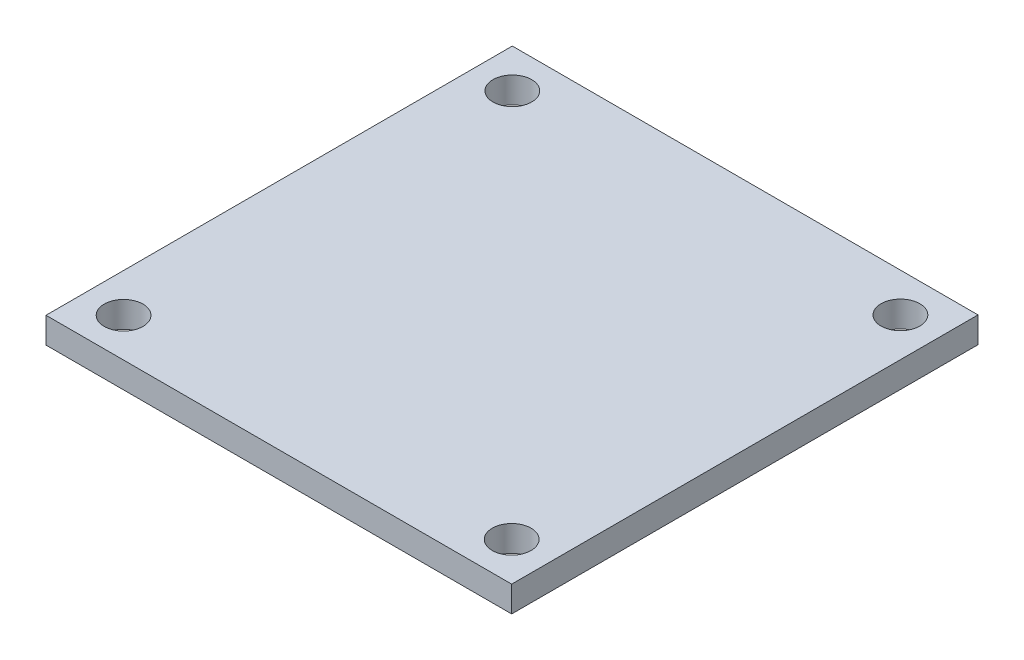
ISO-10303-21;
HEADER;
FILE_DESCRIPTION(('STEP AP214'),'2;1');
FILE_NAME('part.step','',(''),(''),'','','');
FILE_SCHEMA(('AUTOMOTIVE_DESIGN { 1 0 10303 214 1 1 1 1 }'));
ENDSEC;
DATA;
#1=APPLICATION_CONTEXT('core data for automotive mechanical design processes');
#2=APPLICATION_PROTOCOL_DEFINITION('international standard','automotive_design',2000,#1);
#3=PRODUCT_CONTEXT('',#1,'mechanical');
#4=PRODUCT('Part','Part','',(#3));
#5=PRODUCT_RELATED_PRODUCT_CATEGORY('part','',(#4));
#6=PRODUCT_DEFINITION_FORMATION('','',#4);
#7=PRODUCT_DEFINITION_CONTEXT('part definition',#1,'design');
#8=PRODUCT_DEFINITION('design','',#6,#7);
#9=PRODUCT_DEFINITION_SHAPE('','',#8);
#10=(LENGTH_UNIT() NAMED_UNIT(*) SI_UNIT(.MILLI.,.METRE.));
#11=(NAMED_UNIT(*) PLANE_ANGLE_UNIT() SI_UNIT($,.RADIAN.));
#12=(NAMED_UNIT(*) SI_UNIT($,.STERADIAN.) SOLID_ANGLE_UNIT());
#13=UNCERTAINTY_MEASURE_WITH_UNIT(LENGTH_MEASURE(1.E-05),#10,'distance_accuracy_value','');
#14=(GEOMETRIC_REPRESENTATION_CONTEXT(3) GLOBAL_UNCERTAINTY_ASSIGNED_CONTEXT((#13)) GLOBAL_UNIT_ASSIGNED_CONTEXT((#10,
#11,#12)) REPRESENTATION_CONTEXT('',''));
#15=CARTESIAN_POINT('',(0.,0.,0.));
#16=DIRECTION('',(0.,0.,1.));
#17=DIRECTION('',(1.,0.,0.));
#18=AXIS2_PLACEMENT_3D('',#15,#16,#17);
#19=CARTESIAN_POINT('',(0.,2.,0.));
#20=DIRECTION('',(0.,-1.,0.));
#21=DIRECTION('',(0.,0.,-1.));
#22=AXIS2_PLACEMENT_3D('',#19,#20,#21);
#23=PLANE('',#22);
#24=DIRECTION('',(0.,0.,-1.));
#25=VECTOR('',#24,1.);
#26=CARTESIAN_POINT('',(18.0086,2.,18.034));
#27=LINE('',#26,#25);
#28=CARTESIAN_POINT('',(18.0086,2.,18.034));
#29=VERTEX_POINT('',#28);
#30=CARTESIAN_POINT('',(18.0086,2.,-18.034));
#31=VERTEX_POINT('',#30);
#32=EDGE_CURVE('E84',#29,#31,#27,.T.);
#33=ORIENTED_EDGE('',*,*,#32,.T.);
#34=DIRECTION('',(-1.,0.,0.));
#35=VECTOR('',#34,1.);
#36=CARTESIAN_POINT('',(-18.0086,2.,-18.034));
#37=LINE('',#36,#35);
#38=CARTESIAN_POINT('',(-18.0086,2.,-18.034));
#39=VERTEX_POINT('',#38);
#40=EDGE_CURVE('E79',#31,#39,#37,.T.);
#41=ORIENTED_EDGE('',*,*,#40,.T.);
#42=DIRECTION('',(0.,0.,1.));
#43=VECTOR('',#42,1.);
#44=CARTESIAN_POINT('',(-18.0086,2.,18.034));
#45=LINE('',#44,#43);
#46=CARTESIAN_POINT('',(-18.0086,2.,18.034));
#47=VERTEX_POINT('',#46);
#48=EDGE_CURVE('E82',#39,#47,#45,.T.);
#49=ORIENTED_EDGE('',*,*,#48,.T.);
#50=DIRECTION('',(1.,0.,0.));
#51=VECTOR('',#50,1.);
#52=CARTESIAN_POINT('',(-18.0086,2.,18.034));
#53=LINE('',#52,#51);
#54=EDGE_CURVE('E49',#47,#29,#53,.T.);
#55=ORIENTED_EDGE('',*,*,#54,.T.);
#56=EDGE_LOOP('',(#33,#41,#49,#55));
#57=FACE_BOUND('',#56,.T.);
#58=CARTESIAN_POINT('',(-15.0086,2.,-15.034));
#59=DIRECTION('',(0.,1.,0.));
#60=DIRECTION('',(0.,0.,1.));
#61=AXIS2_PLACEMENT_3D('',#58,#59,#60);
#62=CIRCLE('',#61,1.5);
#63=CARTESIAN_POINT('',(-15.0086,2.,-13.534));
#64=VERTEX_POINT('',#63);
#65=EDGE_CURVE('E99',#64,#64,#62,.T.);
#66=ORIENTED_EDGE('',*,*,#65,.F.);
#67=EDGE_LOOP('',(#66));
#68=FACE_BOUND('',#67,.T.);
#69=CARTESIAN_POINT('',(15.0086,2.,-15.034));
#70=DIRECTION('',(0.,1.,0.));
#71=DIRECTION('',(0.,0.,-1.));
#72=AXIS2_PLACEMENT_3D('',#69,#70,#71);
#73=CIRCLE('',#72,1.5);
#74=CARTESIAN_POINT('',(15.0086,2.,-16.534));
#75=VERTEX_POINT('',#74);
#76=EDGE_CURVE('E114',#75,#75,#73,.T.);
#77=ORIENTED_EDGE('',*,*,#76,.F.);
#78=EDGE_LOOP('',(#77));
#79=FACE_BOUND('',#78,.T.);
#80=CARTESIAN_POINT('',(-15.0086,2.,15.034));
#81=DIRECTION('',(0.,1.,0.));
#82=DIRECTION('',(0.,0.,-1.));
#83=AXIS2_PLACEMENT_3D('',#80,#81,#82);
#84=CIRCLE('',#83,1.5);
#85=CARTESIAN_POINT('',(-15.0086,2.,13.534));
#86=VERTEX_POINT('',#85);
#87=EDGE_CURVE('E120',#86,#86,#84,.T.);
#88=ORIENTED_EDGE('',*,*,#87,.F.);
#89=EDGE_LOOP('',(#88));
#90=FACE_BOUND('',#89,.T.);
#91=CARTESIAN_POINT('',(15.0086,2.,15.034));
#92=DIRECTION('',(0.,1.,0.));
#93=DIRECTION('',(0.,0.,1.));
#94=AXIS2_PLACEMENT_3D('',#91,#92,#93);
#95=CIRCLE('',#94,1.5);
#96=CARTESIAN_POINT('',(15.0086,2.,16.534));
#97=VERTEX_POINT('',#96);
#98=EDGE_CURVE('E126',#97,#97,#95,.T.);
#99=ORIENTED_EDGE('',*,*,#98,.F.);
#100=EDGE_LOOP('',(#99));
#101=FACE_BOUND('',#100,.T.);
#102=ADVANCED_FACE('F32',(#57,#68,#79,#90,#101),#23,.F.);
#103=CARTESIAN_POINT('',(0.,0.,0.));
#104=DIRECTION('',(0.,-1.,0.));
#105=DIRECTION('',(0.,0.,-1.));
#106=AXIS2_PLACEMENT_3D('',#103,#104,#105);
#107=PLANE('',#106);
#108=CARTESIAN_POINT('',(-15.0086,0.,15.034));
#109=DIRECTION('',(0.,1.,0.));
#110=DIRECTION('',(0.,0.,-1.));
#111=AXIS2_PLACEMENT_3D('',#108,#109,#110);
#112=CIRCLE('',#111,1.5);
#113=CARTESIAN_POINT('',(-15.0086,0.,13.534));
#114=VERTEX_POINT('',#113);
#115=EDGE_CURVE('E123',#114,#114,#112,.T.);
#116=ORIENTED_EDGE('',*,*,#115,.T.);
#117=EDGE_LOOP('',(#116));
#118=FACE_BOUND('',#117,.T.);
#119=CARTESIAN_POINT('',(-15.0086,0.,-15.034));
#120=DIRECTION('',(0.,1.,0.));
#121=DIRECTION('',(0.,0.,1.));
#122=AXIS2_PLACEMENT_3D('',#119,#120,#121);
#123=CIRCLE('',#122,1.5);
#124=CARTESIAN_POINT('',(-15.0086,0.,-13.534));
#125=VERTEX_POINT('',#124);
#126=EDGE_CURVE('E111',#125,#125,#123,.T.);
#127=ORIENTED_EDGE('',*,*,#126,.T.);
#128=EDGE_LOOP('',(#127));
#129=FACE_BOUND('',#128,.T.);
#130=DIRECTION('',(0.,0.,-1.));
#131=VECTOR('',#130,1.);
#132=CARTESIAN_POINT('',(18.0086,0.,18.034));
#133=LINE('',#132,#131);
#134=CARTESIAN_POINT('',(18.0086,0.,18.034));
#135=VERTEX_POINT('',#134);
#136=CARTESIAN_POINT('',(18.0086,0.,-18.034));
#137=VERTEX_POINT('',#136);
#138=EDGE_CURVE('E96',#135,#137,#133,.T.);
#139=ORIENTED_EDGE('',*,*,#138,.F.);
#140=DIRECTION('',(1.,0.,0.));
#141=VECTOR('',#140,1.);
#142=CARTESIAN_POINT('',(-18.0086,0.,18.034));
#143=LINE('',#142,#141);
#144=CARTESIAN_POINT('',(-18.0086,0.,18.034));
#145=VERTEX_POINT('',#144);
#146=EDGE_CURVE('E72',#145,#135,#143,.T.);
#147=ORIENTED_EDGE('',*,*,#146,.F.);
#148=DIRECTION('',(0.,0.,1.));
#149=VECTOR('',#148,1.);
#150=CARTESIAN_POINT('',(-18.0086,0.,18.034));
#151=LINE('',#150,#149);
#152=CARTESIAN_POINT('',(-18.0086,0.,-18.034));
#153=VERTEX_POINT('',#152);
#154=EDGE_CURVE('E66',#153,#145,#151,.T.);
#155=ORIENTED_EDGE('',*,*,#154,.F.);
#156=DIRECTION('',(-1.,0.,0.));
#157=VECTOR('',#156,1.);
#158=CARTESIAN_POINT('',(-18.0086,0.,-18.034));
#159=LINE('',#158,#157);
#160=EDGE_CURVE('E88',#137,#153,#159,.T.);
#161=ORIENTED_EDGE('',*,*,#160,.F.);
#162=EDGE_LOOP('',(#139,#147,#155,#161));
#163=FACE_BOUND('',#162,.T.);
#164=CARTESIAN_POINT('',(15.0086,0.,-15.034));
#165=DIRECTION('',(0.,1.,0.));
#166=DIRECTION('',(0.,0.,-1.));
#167=AXIS2_PLACEMENT_3D('',#164,#165,#166);
#168=CIRCLE('',#167,1.5);
#169=CARTESIAN_POINT('',(15.0086,0.,-16.534));
#170=VERTEX_POINT('',#169);
#171=EDGE_CURVE('E117',#170,#170,#168,.T.);
#172=ORIENTED_EDGE('',*,*,#171,.T.);
#173=EDGE_LOOP('',(#172));
#174=FACE_BOUND('',#173,.T.);
#175=CARTESIAN_POINT('',(15.0086,0.,15.034));
#176=DIRECTION('',(0.,1.,0.));
#177=DIRECTION('',(0.,0.,1.));
#178=AXIS2_PLACEMENT_3D('',#175,#176,#177);
#179=CIRCLE('',#178,1.5);
#180=CARTESIAN_POINT('',(15.0086,0.,16.534));
#181=VERTEX_POINT('',#180);
#182=EDGE_CURVE('E129',#181,#181,#179,.T.);
#183=ORIENTED_EDGE('',*,*,#182,.T.);
#184=EDGE_LOOP('',(#183));
#185=FACE_BOUND('',#184,.T.);
#186=ADVANCED_FACE('F107',(#118,#129,#163,#174,#185),#107,.T.);
#187=CARTESIAN_POINT('',(18.0086,2.,18.034));
#188=DIRECTION('',(-1.,0.,0.));
#189=DIRECTION('',(0.,0.,1.));
#190=AXIS2_PLACEMENT_3D('',#187,#188,#189);
#191=PLANE('',#190);
#192=ORIENTED_EDGE('',*,*,#138,.T.);
#193=DIRECTION('',(0.,-1.,0.));
#194=VECTOR('',#193,1.);
#195=CARTESIAN_POINT('',(18.0086,2.,-18.034));
#196=LINE('',#195,#194);
#197=EDGE_CURVE('E11',#31,#137,#196,.T.);
#198=ORIENTED_EDGE('',*,*,#197,.F.);
#199=ORIENTED_EDGE('',*,*,#32,.F.);
#200=DIRECTION('',(0.,-1.,0.));
#201=VECTOR('',#200,1.);
#202=CARTESIAN_POINT('',(18.0086,2.,18.034));
#203=LINE('',#202,#201);
#204=EDGE_CURVE('E92',#29,#135,#203,.T.);
#205=ORIENTED_EDGE('',*,*,#204,.T.);
#206=EDGE_LOOP('',(#192,#198,#199,#205));
#207=FACE_BOUND('',#206,.T.);
#208=ADVANCED_FACE('F34',(#207),#191,.F.);
#209=CARTESIAN_POINT('',(-18.0086,2.,-18.034));
#210=DIRECTION('',(0.,0.,1.));
#211=DIRECTION('',(1.,0.,0.));
#212=AXIS2_PLACEMENT_3D('',#209,#210,#211);
#213=PLANE('',#212);
#214=ORIENTED_EDGE('',*,*,#160,.T.);
#215=DIRECTION('',(0.,-1.,0.));
#216=VECTOR('',#215,1.);
#217=CARTESIAN_POINT('',(-18.0086,2.,-18.034));
#218=LINE('',#217,#216);
#219=EDGE_CURVE('E41',#39,#153,#218,.T.);
#220=ORIENTED_EDGE('',*,*,#219,.F.);
#221=ORIENTED_EDGE('',*,*,#40,.F.);
#222=ORIENTED_EDGE('',*,*,#197,.T.);
#223=EDGE_LOOP('',(#214,#220,#221,#222));
#224=FACE_BOUND('',#223,.T.);
#225=ADVANCED_FACE('F87',(#224),#213,.F.);
#226=CARTESIAN_POINT('',(-18.0086,2.,18.034));
#227=DIRECTION('',(1.,0.,0.));
#228=DIRECTION('',(0.,0.,-1.));
#229=AXIS2_PLACEMENT_3D('',#226,#227,#228);
#230=PLANE('',#229);
#231=ORIENTED_EDGE('',*,*,#154,.T.);
#232=DIRECTION('',(0.,-1.,0.));
#233=VECTOR('',#232,1.);
#234=CARTESIAN_POINT('',(-18.0086,2.,18.034));
#235=LINE('',#234,#233);
#236=EDGE_CURVE('E89',#47,#145,#235,.T.);
#237=ORIENTED_EDGE('',*,*,#236,.F.);
#238=ORIENTED_EDGE('',*,*,#48,.F.);
#239=ORIENTED_EDGE('',*,*,#219,.T.);
#240=EDGE_LOOP('',(#231,#237,#238,#239));
#241=FACE_BOUND('',#240,.T.);
#242=ADVANCED_FACE('F90',(#241),#230,.F.);
#243=CARTESIAN_POINT('',(-18.0086,2.,18.034));
#244=DIRECTION('',(0.,0.,-1.));
#245=DIRECTION('',(-1.,0.,0.));
#246=AXIS2_PLACEMENT_3D('',#243,#244,#245);
#247=PLANE('',#246);
#248=ORIENTED_EDGE('',*,*,#146,.T.);
#249=ORIENTED_EDGE('',*,*,#204,.F.);
#250=ORIENTED_EDGE('',*,*,#54,.F.);
#251=ORIENTED_EDGE('',*,*,#236,.T.);
#252=EDGE_LOOP('',(#248,#249,#250,#251));
#253=FACE_BOUND('',#252,.T.);
#254=ADVANCED_FACE('F104',(#253),#247,.F.);
#255=CARTESIAN_POINT('',(-15.0086,2.,-15.034));
#256=DIRECTION('',(0.,-1.,0.));
#257=DIRECTION('',(0.,0.,-1.));
#258=AXIS2_PLACEMENT_3D('',#255,#256,#257);
#259=CYLINDRICAL_SURFACE('',#258,1.5);
#260=ORIENTED_EDGE('',*,*,#65,.T.);
#261=EDGE_LOOP('',(#260));
#262=FACE_BOUND('',#261,.T.);
#263=ORIENTED_EDGE('',*,*,#126,.F.);
#264=EDGE_LOOP('',(#263));
#265=FACE_BOUND('',#264,.T.);
#266=ADVANCED_FACE('F146',(#262,#265),#259,.F.);
#267=CARTESIAN_POINT('',(15.0086,2.,-15.034));
#268=DIRECTION('',(0.,-1.,0.));
#269=DIRECTION('',(0.,0.,-1.));
#270=AXIS2_PLACEMENT_3D('',#267,#268,#269);
#271=CYLINDRICAL_SURFACE('',#270,1.5);
#272=ORIENTED_EDGE('',*,*,#76,.T.);
#273=EDGE_LOOP('',(#272));
#274=FACE_BOUND('',#273,.T.);
#275=ORIENTED_EDGE('',*,*,#171,.F.);
#276=EDGE_LOOP('',(#275));
#277=FACE_BOUND('',#276,.T.);
#278=ADVANCED_FACE('F192',(#274,#277),#271,.F.);
#279=CARTESIAN_POINT('',(-15.0086,2.,15.034));
#280=DIRECTION('',(0.,-1.,0.));
#281=DIRECTION('',(0.,0.,-1.));
#282=AXIS2_PLACEMENT_3D('',#279,#280,#281);
#283=CYLINDRICAL_SURFACE('',#282,1.5);
#284=ORIENTED_EDGE('',*,*,#87,.T.);
#285=EDGE_LOOP('',(#284));
#286=FACE_BOUND('',#285,.T.);
#287=ORIENTED_EDGE('',*,*,#115,.F.);
#288=EDGE_LOOP('',(#287));
#289=FACE_BOUND('',#288,.T.);
#290=ADVANCED_FACE('F200',(#286,#289),#283,.F.);
#291=CARTESIAN_POINT('',(15.0086,2.,15.034));
#292=DIRECTION('',(0.,-1.,0.));
#293=DIRECTION('',(0.,0.,-1.));
#294=AXIS2_PLACEMENT_3D('',#291,#292,#293);
#295=CYLINDRICAL_SURFACE('',#294,1.5);
#296=ORIENTED_EDGE('',*,*,#98,.T.);
#297=EDGE_LOOP('',(#296));
#298=FACE_BOUND('',#297,.T.);
#299=ORIENTED_EDGE('',*,*,#182,.F.);
#300=EDGE_LOOP('',(#299));
#301=FACE_BOUND('',#300,.T.);
#302=ADVANCED_FACE('F135',(#298,#301),#295,.F.);
#303=CLOSED_SHELL('',(#102,#186,#208,#225,#242,#254,#266,#278,#290,#302));
#304=MANIFOLD_SOLID_BREP('B2',#303);
#305=ADVANCED_BREP_SHAPE_REPRESENTATION('',(#18,#304),#14);
#306=SHAPE_DEFINITION_REPRESENTATION(#9,#305);
ENDSEC;
END-ISO-10303-21;
